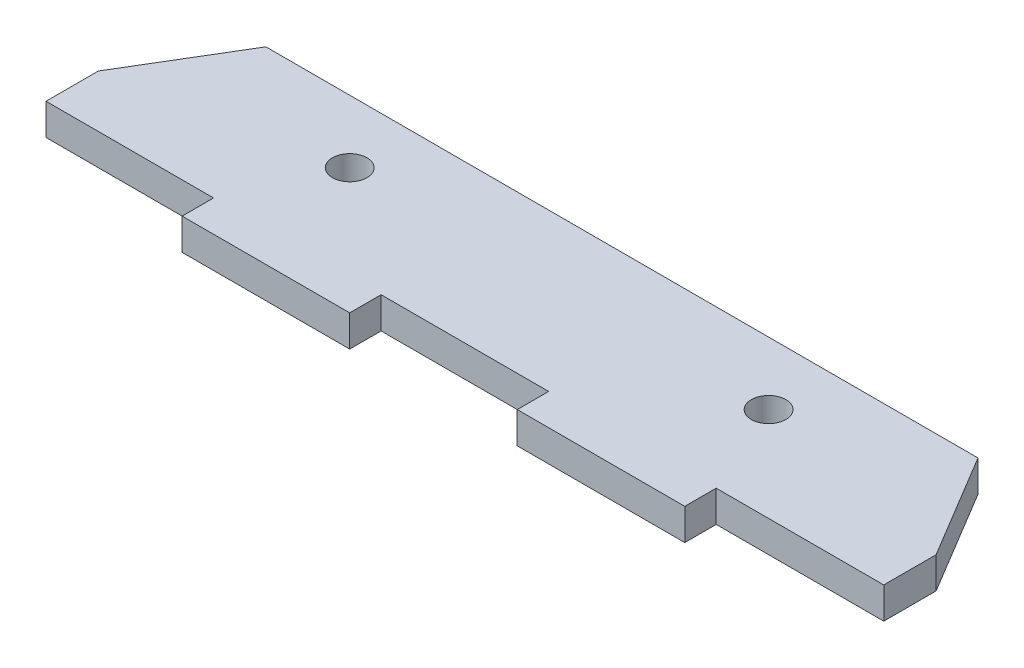
ISO-10303-21;
HEADER;
FILE_DESCRIPTION(('STEP AP214'),'2;1');
FILE_NAME('part.step','',(''),(''),'','','');
FILE_SCHEMA(('AUTOMOTIVE_DESIGN { 1 0 10303 214 1 1 1 1 }'));
ENDSEC;
DATA;
#1=APPLICATION_CONTEXT('core data for automotive mechanical design processes');
#2=APPLICATION_PROTOCOL_DEFINITION('international standard','automotive_design',2000,#1);
#3=PRODUCT_CONTEXT('',#1,'mechanical');
#4=PRODUCT('Part','Part','',(#3));
#5=PRODUCT_RELATED_PRODUCT_CATEGORY('part','',(#4));
#6=PRODUCT_DEFINITION_FORMATION('','',#4);
#7=PRODUCT_DEFINITION_CONTEXT('part definition',#1,'design');
#8=PRODUCT_DEFINITION('design','',#6,#7);
#9=PRODUCT_DEFINITION_SHAPE('','',#8);
#10=(LENGTH_UNIT() NAMED_UNIT(*) SI_UNIT(.MILLI.,.METRE.));
#11=(NAMED_UNIT(*) PLANE_ANGLE_UNIT() SI_UNIT($,.RADIAN.));
#12=(NAMED_UNIT(*) SI_UNIT($,.STERADIAN.) SOLID_ANGLE_UNIT());
#13=UNCERTAINTY_MEASURE_WITH_UNIT(LENGTH_MEASURE(1.E-05),#10,'distance_accuracy_value','');
#14=(GEOMETRIC_REPRESENTATION_CONTEXT(3) GLOBAL_UNCERTAINTY_ASSIGNED_CONTEXT((#13)) GLOBAL_UNIT_ASSIGNED_CONTEXT((#10,
#11,#12)) REPRESENTATION_CONTEXT('',''));
#15=CARTESIAN_POINT('',(0.,0.,0.));
#16=DIRECTION('',(0.,0.,1.));
#17=DIRECTION('',(1.,0.,0.));
#18=AXIS2_PLACEMENT_3D('',#15,#16,#17);
#19=CARTESIAN_POINT('',(0.,3.,0.));
#20=DIRECTION('',(0.,-1.,0.));
#21=DIRECTION('',(0.,0.,-1.));
#22=AXIS2_PLACEMENT_3D('',#19,#20,#21);
#23=PLANE('',#22);
#24=DIRECTION('',(-1.,0.,0.));
#25=VECTOR('',#24,1.);
#26=CARTESIAN_POINT('',(-34.,3.,-9.));
#27=LINE('',#26,#25);
#28=CARTESIAN_POINT('',(34.,3.,-9.));
#29=VERTEX_POINT('',#28);
#30=CARTESIAN_POINT('',(-34.,3.,-9.));
#31=VERTEX_POINT('',#30);
#32=EDGE_CURVE('E193',#29,#31,#27,.T.);
#33=ORIENTED_EDGE('',*,*,#32,.T.);
#34=DIRECTION('',(-0.514495755427526,0.,0.857492925712545));
#35=VECTOR('',#34,1.);
#36=CARTESIAN_POINT('',(-40.,3.,0.999999999999999));
#37=LINE('',#36,#35);
#38=CARTESIAN_POINT('',(-40.,3.,0.999999999999999));
#39=VERTEX_POINT('',#38);
#40=EDGE_CURVE('E111',#31,#39,#37,.T.);
#41=ORIENTED_EDGE('',*,*,#40,.T.);
#42=DIRECTION('',(0.,0.,1.));
#43=VECTOR('',#42,1.);
#44=CARTESIAN_POINT('',(-40.,3.,0.999999999999999));
#45=LINE('',#44,#43);
#46=CARTESIAN_POINT('',(-40.,3.,6.));
#47=VERTEX_POINT('',#46);
#48=EDGE_CURVE('E226',#39,#47,#45,.T.);
#49=ORIENTED_EDGE('',*,*,#48,.T.);
#50=DIRECTION('',(1.,0.,0.));
#51=VECTOR('',#50,1.);
#52=CARTESIAN_POINT('',(-40.,3.,6.));
#53=LINE('',#52,#51);
#54=CARTESIAN_POINT('',(-24.,3.,6.));
#55=VERTEX_POINT('',#54);
#56=EDGE_CURVE('E245',#47,#55,#53,.T.);
#57=ORIENTED_EDGE('',*,*,#56,.T.);
#58=DIRECTION('',(0.,0.,1.));
#59=VECTOR('',#58,1.);
#60=CARTESIAN_POINT('',(-24.,3.,6.));
#61=LINE('',#60,#59);
#62=CARTESIAN_POINT('',(-24.,3.,9.));
#63=VERTEX_POINT('',#62);
#64=EDGE_CURVE('E242',#55,#63,#61,.T.);
#65=ORIENTED_EDGE('',*,*,#64,.T.);
#66=DIRECTION('',(1.,0.,0.));
#67=VECTOR('',#66,1.);
#68=CARTESIAN_POINT('',(-24.,3.,9.));
#69=LINE('',#68,#67);
#70=CARTESIAN_POINT('',(-8.,3.,8.99999999999999));
#71=VERTEX_POINT('',#70);
#72=EDGE_CURVE('E244',#63,#71,#69,.T.);
#73=ORIENTED_EDGE('',*,*,#72,.T.);
#74=DIRECTION('',(0.,0.,-1.));
#75=VECTOR('',#74,1.);
#76=CARTESIAN_POINT('',(-8.,3.,8.99999999999999));
#77=LINE('',#76,#75);
#78=CARTESIAN_POINT('',(-8.,3.,6.));
#79=VERTEX_POINT('',#78);
#80=EDGE_CURVE('E247',#71,#79,#77,.T.);
#81=ORIENTED_EDGE('',*,*,#80,.T.);
#82=DIRECTION('',(1.,0.,0.));
#83=VECTOR('',#82,1.);
#84=CARTESIAN_POINT('',(-8.,3.,6.));
#85=LINE('',#84,#83);
#86=CARTESIAN_POINT('',(8.,3.,6.));
#87=VERTEX_POINT('',#86);
#88=EDGE_CURVE('E253',#79,#87,#85,.T.);
#89=ORIENTED_EDGE('',*,*,#88,.T.);
#90=DIRECTION('',(0.,0.,1.));
#91=VECTOR('',#90,1.);
#92=CARTESIAN_POINT('',(8.,3.,6.));
#93=LINE('',#92,#91);
#94=CARTESIAN_POINT('',(8.,3.,9.));
#95=VERTEX_POINT('',#94);
#96=EDGE_CURVE('E255',#87,#95,#93,.T.);
#97=ORIENTED_EDGE('',*,*,#96,.T.);
#98=DIRECTION('',(1.,0.,0.));
#99=VECTOR('',#98,1.);
#100=CARTESIAN_POINT('',(8.,3.,9.));
#101=LINE('',#100,#99);
#102=CARTESIAN_POINT('',(24.,3.,8.99999999999999));
#103=VERTEX_POINT('',#102);
#104=EDGE_CURVE('E257',#95,#103,#101,.T.);
#105=ORIENTED_EDGE('',*,*,#104,.T.);
#106=DIRECTION('',(0.,0.,-1.));
#107=VECTOR('',#106,1.);
#108=CARTESIAN_POINT('',(24.,3.,8.99999999999999));
#109=LINE('',#108,#107);
#110=CARTESIAN_POINT('',(24.,3.,6.));
#111=VERTEX_POINT('',#110);
#112=EDGE_CURVE('E148',#103,#111,#109,.T.);
#113=ORIENTED_EDGE('',*,*,#112,.T.);
#114=DIRECTION('',(1.,0.,0.));
#115=VECTOR('',#114,1.);
#116=CARTESIAN_POINT('',(24.,3.,6.));
#117=LINE('',#116,#115);
#118=CARTESIAN_POINT('',(40.,3.,6.));
#119=VERTEX_POINT('',#118);
#120=EDGE_CURVE('E142',#111,#119,#117,.T.);
#121=ORIENTED_EDGE('',*,*,#120,.T.);
#122=DIRECTION('',(0.,0.,-1.));
#123=VECTOR('',#122,1.);
#124=CARTESIAN_POINT('',(40.,3.,0.999999999999999));
#125=LINE('',#124,#123);
#126=CARTESIAN_POINT('',(40.,3.,0.999999999999999));
#127=VERTEX_POINT('',#126);
#128=EDGE_CURVE('E146',#119,#127,#125,.T.);
#129=ORIENTED_EDGE('',*,*,#128,.T.);
#130=DIRECTION('',(-0.514495755427526,0.,-0.857492925712545));
#131=VECTOR('',#130,1.);
#132=CARTESIAN_POINT('',(34.,3.,-9.));
#133=LINE('',#132,#131);
#134=EDGE_CURVE('E50',#127,#29,#133,.T.);
#135=ORIENTED_EDGE('',*,*,#134,.T.);
#136=EDGE_LOOP('',(#33,#41,#49,#57,#65,#73,#81,#89,#97,#105,#113,#121,#129,#135));
#137=FACE_BOUND('',#136,.T.);
#138=CARTESIAN_POINT('',(-20.,3.,-3.00310366211029));
#139=DIRECTION('',(0.,1.,0.));
#140=DIRECTION('',(0.,0.,1.));
#141=AXIS2_PLACEMENT_3D('',#138,#139,#140);
#142=CIRCLE('',#141,1.65);
#143=CARTESIAN_POINT('',(-20.,3.,-1.35310366211029));
#144=VERTEX_POINT('',#143);
#145=EDGE_CURVE('E170',#144,#144,#142,.T.);
#146=ORIENTED_EDGE('',*,*,#145,.F.);
#147=EDGE_LOOP('',(#146));
#148=FACE_BOUND('',#147,.T.);
#149=CARTESIAN_POINT('',(20.,3.,-3.00310366211029));
#150=DIRECTION('',(0.,1.,0.));
#151=DIRECTION('',(0.,0.,1.));
#152=AXIS2_PLACEMENT_3D('',#149,#150,#151);
#153=CIRCLE('',#152,1.65);
#154=CARTESIAN_POINT('',(20.,3.,-1.35310366211029));
#155=VERTEX_POINT('',#154);
#156=EDGE_CURVE('E298',#155,#155,#153,.T.);
#157=ORIENTED_EDGE('',*,*,#156,.F.);
#158=EDGE_LOOP('',(#157));
#159=FACE_BOUND('',#158,.T.);
#160=ADVANCED_FACE('F33',(#137,#148,#159),#23,.F.);
#161=CARTESIAN_POINT('',(0.,0.,0.));
#162=DIRECTION('',(0.,-1.,0.));
#163=DIRECTION('',(0.,0.,-1.));
#164=AXIS2_PLACEMENT_3D('',#161,#162,#163);
#165=PLANE('',#164);
#166=CARTESIAN_POINT('',(-20.,0.,-3.00310366211029));
#167=DIRECTION('',(0.,1.,0.));
#168=DIRECTION('',(0.,0.,1.));
#169=AXIS2_PLACEMENT_3D('',#166,#167,#168);
#170=CIRCLE('',#169,1.65);
#171=CARTESIAN_POINT('',(-20.,0.,-1.35310366211029));
#172=VERTEX_POINT('',#171);
#173=EDGE_CURVE('E303',#172,#172,#170,.T.);
#174=ORIENTED_EDGE('',*,*,#173,.T.);
#175=EDGE_LOOP('',(#174));
#176=FACE_BOUND('',#175,.T.);
#177=DIRECTION('',(-1.,0.,0.));
#178=VECTOR('',#177,1.);
#179=CARTESIAN_POINT('',(-34.,0.,-9.));
#180=LINE('',#179,#178);
#181=CARTESIAN_POINT('',(34.,0.,-9.));
#182=VERTEX_POINT('',#181);
#183=CARTESIAN_POINT('',(-34.,0.,-9.));
#184=VERTEX_POINT('',#183);
#185=EDGE_CURVE('E166',#182,#184,#180,.T.);
#186=ORIENTED_EDGE('',*,*,#185,.F.);
#187=DIRECTION('',(-0.514495755427526,0.,-0.857492925712545));
#188=VECTOR('',#187,1.);
#189=CARTESIAN_POINT('',(34.,0.,-9.));
#190=LINE('',#189,#188);
#191=CARTESIAN_POINT('',(40.,0.,0.999999999999999));
#192=VERTEX_POINT('',#191);
#193=EDGE_CURVE('E103',#192,#182,#190,.T.);
#194=ORIENTED_EDGE('',*,*,#193,.F.);
#195=DIRECTION('',(0.,0.,-1.));
#196=VECTOR('',#195,1.);
#197=CARTESIAN_POINT('',(40.,0.,0.999999999999999));
#198=LINE('',#197,#196);
#199=CARTESIAN_POINT('',(40.,0.,6.));
#200=VERTEX_POINT('',#199);
#201=EDGE_CURVE('E97',#200,#192,#198,.T.);
#202=ORIENTED_EDGE('',*,*,#201,.F.);
#203=DIRECTION('',(1.,0.,0.));
#204=VECTOR('',#203,1.);
#205=CARTESIAN_POINT('',(24.,0.,6.));
#206=LINE('',#205,#204);
#207=CARTESIAN_POINT('',(24.,0.,6.));
#208=VERTEX_POINT('',#207);
#209=EDGE_CURVE('E156',#208,#200,#206,.T.);
#210=ORIENTED_EDGE('',*,*,#209,.F.);
#211=DIRECTION('',(0.,0.,-1.));
#212=VECTOR('',#211,1.);
#213=CARTESIAN_POINT('',(24.,0.,8.99999999999999));
#214=LINE('',#213,#212);
#215=CARTESIAN_POINT('',(24.,0.,8.99999999999999));
#216=VERTEX_POINT('',#215);
#217=EDGE_CURVE('E188',#216,#208,#214,.T.);
#218=ORIENTED_EDGE('',*,*,#217,.F.);
#219=DIRECTION('',(1.,0.,0.));
#220=VECTOR('',#219,1.);
#221=CARTESIAN_POINT('',(8.,0.,9.));
#222=LINE('',#221,#220);
#223=CARTESIAN_POINT('',(8.,0.,9.));
#224=VERTEX_POINT('',#223);
#225=EDGE_CURVE('E186',#224,#216,#222,.T.);
#226=ORIENTED_EDGE('',*,*,#225,.F.);
#227=DIRECTION('',(0.,0.,1.));
#228=VECTOR('',#227,1.);
#229=CARTESIAN_POINT('',(8.,0.,6.));
#230=LINE('',#229,#228);
#231=CARTESIAN_POINT('',(8.,0.,6.));
#232=VERTEX_POINT('',#231);
#233=EDGE_CURVE('E184',#232,#224,#230,.T.);
#234=ORIENTED_EDGE('',*,*,#233,.F.);
#235=DIRECTION('',(1.,0.,0.));
#236=VECTOR('',#235,1.);
#237=CARTESIAN_POINT('',(-8.,0.,6.));
#238=LINE('',#237,#236);
#239=CARTESIAN_POINT('',(-8.,0.,6.));
#240=VERTEX_POINT('',#239);
#241=EDGE_CURVE('E182',#240,#232,#238,.T.);
#242=ORIENTED_EDGE('',*,*,#241,.F.);
#243=DIRECTION('',(0.,0.,-1.));
#244=VECTOR('',#243,1.);
#245=CARTESIAN_POINT('',(-8.,0.,8.99999999999999));
#246=LINE('',#245,#244);
#247=CARTESIAN_POINT('',(-8.,0.,8.99999999999999));
#248=VERTEX_POINT('',#247);
#249=EDGE_CURVE('E180',#248,#240,#246,.T.);
#250=ORIENTED_EDGE('',*,*,#249,.F.);
#251=DIRECTION('',(1.,0.,0.));
#252=VECTOR('',#251,1.);
#253=CARTESIAN_POINT('',(-24.,0.,9.));
#254=LINE('',#253,#252);
#255=CARTESIAN_POINT('',(-24.,0.,9.));
#256=VERTEX_POINT('',#255);
#257=EDGE_CURVE('E178',#256,#248,#254,.T.);
#258=ORIENTED_EDGE('',*,*,#257,.F.);
#259=DIRECTION('',(0.,0.,1.));
#260=VECTOR('',#259,1.);
#261=CARTESIAN_POINT('',(-24.,0.,6.));
#262=LINE('',#261,#260);
#263=CARTESIAN_POINT('',(-24.,0.,6.));
#264=VERTEX_POINT('',#263);
#265=EDGE_CURVE('E176',#264,#256,#262,.T.);
#266=ORIENTED_EDGE('',*,*,#265,.F.);
#267=DIRECTION('',(1.,0.,0.));
#268=VECTOR('',#267,1.);
#269=CARTESIAN_POINT('',(-40.,0.,6.));
#270=LINE('',#269,#268);
#271=CARTESIAN_POINT('',(-40.,0.,6.));
#272=VERTEX_POINT('',#271);
#273=EDGE_CURVE('E174',#272,#264,#270,.T.);
#274=ORIENTED_EDGE('',*,*,#273,.F.);
#275=DIRECTION('',(0.,0.,1.));
#276=VECTOR('',#275,1.);
#277=CARTESIAN_POINT('',(-40.,0.,0.999999999999999));
#278=LINE('',#277,#276);
#279=CARTESIAN_POINT('',(-40.,0.,0.999999999999999));
#280=VERTEX_POINT('',#279);
#281=EDGE_CURVE('E172',#280,#272,#278,.T.);
#282=ORIENTED_EDGE('',*,*,#281,.F.);
#283=DIRECTION('',(-0.514495755427526,0.,0.857492925712545));
#284=VECTOR('',#283,1.);
#285=CARTESIAN_POINT('',(-40.,0.,0.999999999999999));
#286=LINE('',#285,#284);
#287=EDGE_CURVE('E169',#184,#280,#286,.T.);
#288=ORIENTED_EDGE('',*,*,#287,.F.);
#289=EDGE_LOOP('',(#186,#194,#202,#210,#218,#226,#234,#242,#250,#258,#266,#274,#282,#288));
#290=FACE_BOUND('',#289,.T.);
#291=CARTESIAN_POINT('',(20.,0.,-3.00310366211029));
#292=DIRECTION('',(0.,1.,0.));
#293=DIRECTION('',(0.,0.,1.));
#294=AXIS2_PLACEMENT_3D('',#291,#292,#293);
#295=CIRCLE('',#294,1.65);
#296=CARTESIAN_POINT('',(20.,0.,-1.35310366211029));
#297=VERTEX_POINT('',#296);
#298=EDGE_CURVE('E301',#297,#297,#295,.T.);
#299=ORIENTED_EDGE('',*,*,#298,.T.);
#300=EDGE_LOOP('',(#299));
#301=FACE_BOUND('',#300,.T.);
#302=ADVANCED_FACE('F230',(#176,#290,#301),#165,.T.);
#303=CARTESIAN_POINT('',(-34.,3.,-9.));
#304=DIRECTION('',(0.,0.,1.));
#305=DIRECTION('',(1.,0.,0.));
#306=AXIS2_PLACEMENT_3D('',#303,#304,#305);
#307=PLANE('',#306);
#308=ORIENTED_EDGE('',*,*,#185,.T.);
#309=DIRECTION('',(0.,-1.,0.));
#310=VECTOR('',#309,1.);
#311=CARTESIAN_POINT('',(-34.,3.,-9.));
#312=LINE('',#311,#310);
#313=EDGE_CURVE('E11',#31,#184,#312,.T.);
#314=ORIENTED_EDGE('',*,*,#313,.F.);
#315=ORIENTED_EDGE('',*,*,#32,.F.);
#316=DIRECTION('',(0.,-1.,0.));
#317=VECTOR('',#316,1.);
#318=CARTESIAN_POINT('',(34.,3.,-9.));
#319=LINE('',#318,#317);
#320=EDGE_CURVE('E162',#29,#182,#319,.T.);
#321=ORIENTED_EDGE('',*,*,#320,.T.);
#322=EDGE_LOOP('',(#308,#314,#315,#321));
#323=FACE_BOUND('',#322,.T.);
#324=ADVANCED_FACE('F35',(#323),#307,.F.);
#325=CARTESIAN_POINT('',(-40.,3.,0.999999999999999));
#326=DIRECTION('',(0.857492925712544,0.,0.514495755427526));
#327=DIRECTION('',(0.514495755427526,0.,-0.857492925712545));
#328=AXIS2_PLACEMENT_3D('',#325,#326,#327);
#329=PLANE('',#328);
#330=ORIENTED_EDGE('',*,*,#287,.T.);
#331=DIRECTION('',(0.,-1.,0.));
#332=VECTOR('',#331,1.);
#333=CARTESIAN_POINT('',(-40.,3.,0.999999999999999));
#334=LINE('',#333,#332);
#335=EDGE_CURVE('E42',#39,#280,#334,.T.);
#336=ORIENTED_EDGE('',*,*,#335,.F.);
#337=ORIENTED_EDGE('',*,*,#40,.F.);
#338=ORIENTED_EDGE('',*,*,#313,.T.);
#339=EDGE_LOOP('',(#330,#336,#337,#338));
#340=FACE_BOUND('',#339,.T.);
#341=ADVANCED_FACE('F418',(#340),#329,.F.);
#342=CARTESIAN_POINT('',(-40.,3.,0.999999999999999));
#343=DIRECTION('',(1.,0.,0.));
#344=DIRECTION('',(0.,0.,-1.));
#345=AXIS2_PLACEMENT_3D('',#342,#343,#344);
#346=PLANE('',#345);
#347=ORIENTED_EDGE('',*,*,#281,.T.);
#348=DIRECTION('',(0.,-1.,0.));
#349=VECTOR('',#348,1.);
#350=CARTESIAN_POINT('',(-40.,3.,6.));
#351=LINE('',#350,#349);
#352=EDGE_CURVE('E218',#47,#272,#351,.T.);
#353=ORIENTED_EDGE('',*,*,#352,.F.);
#354=ORIENTED_EDGE('',*,*,#48,.F.);
#355=ORIENTED_EDGE('',*,*,#335,.T.);
#356=EDGE_LOOP('',(#347,#353,#354,#355));
#357=FACE_BOUND('',#356,.T.);
#358=ADVANCED_FACE('F224',(#357),#346,.F.);
#359=CARTESIAN_POINT('',(-40.,3.,6.));
#360=DIRECTION('',(0.,0.,-1.));
#361=DIRECTION('',(-1.,0.,0.));
#362=AXIS2_PLACEMENT_3D('',#359,#360,#361);
#363=PLANE('',#362);
#364=ORIENTED_EDGE('',*,*,#273,.T.);
#365=DIRECTION('',(0.,-1.,0.));
#366=VECTOR('',#365,1.);
#367=CARTESIAN_POINT('',(-24.,3.,6.));
#368=LINE('',#367,#366);
#369=EDGE_CURVE('E215',#55,#264,#368,.T.);
#370=ORIENTED_EDGE('',*,*,#369,.F.);
#371=ORIENTED_EDGE('',*,*,#56,.F.);
#372=ORIENTED_EDGE('',*,*,#352,.T.);
#373=EDGE_LOOP('',(#364,#370,#371,#372));
#374=FACE_BOUND('',#373,.T.);
#375=ADVANCED_FACE('F236',(#374),#363,.F.);
#376=CARTESIAN_POINT('',(-24.,3.,6.));
#377=DIRECTION('',(1.,0.,0.));
#378=DIRECTION('',(0.,0.,-1.));
#379=AXIS2_PLACEMENT_3D('',#376,#377,#378);
#380=PLANE('',#379);
#381=ORIENTED_EDGE('',*,*,#265,.T.);
#382=DIRECTION('',(0.,-1.,0.));
#383=VECTOR('',#382,1.);
#384=CARTESIAN_POINT('',(-24.,3.,9.));
#385=LINE('',#384,#383);
#386=EDGE_CURVE('E212',#63,#256,#385,.T.);
#387=ORIENTED_EDGE('',*,*,#386,.F.);
#388=ORIENTED_EDGE('',*,*,#64,.F.);
#389=ORIENTED_EDGE('',*,*,#369,.T.);
#390=EDGE_LOOP('',(#381,#387,#388,#389));
#391=FACE_BOUND('',#390,.T.);
#392=ADVANCED_FACE('F240',(#391),#380,.F.);
#393=CARTESIAN_POINT('',(-24.,3.,9.));
#394=DIRECTION('',(0.,0.,-1.));
#395=DIRECTION('',(-1.,0.,0.));
#396=AXIS2_PLACEMENT_3D('',#393,#394,#395);
#397=PLANE('',#396);
#398=ORIENTED_EDGE('',*,*,#257,.T.);
#399=DIRECTION('',(0.,-1.,0.));
#400=VECTOR('',#399,1.);
#401=CARTESIAN_POINT('',(-8.,3.,8.99999999999999));
#402=LINE('',#401,#400);
#403=EDGE_CURVE('E209',#71,#248,#402,.T.);
#404=ORIENTED_EDGE('',*,*,#403,.F.);
#405=ORIENTED_EDGE('',*,*,#72,.F.);
#406=ORIENTED_EDGE('',*,*,#386,.T.);
#407=EDGE_LOOP('',(#398,#404,#405,#406));
#408=FACE_BOUND('',#407,.T.);
#409=ADVANCED_FACE('F383',(#408),#397,.F.);
#410=CARTESIAN_POINT('',(-8.,3.,8.99999999999999));
#411=DIRECTION('',(-1.,0.,0.));
#412=DIRECTION('',(0.,0.,1.));
#413=AXIS2_PLACEMENT_3D('',#410,#411,#412);
#414=PLANE('',#413);
#415=ORIENTED_EDGE('',*,*,#249,.T.);
#416=DIRECTION('',(0.,-1.,0.));
#417=VECTOR('',#416,1.);
#418=CARTESIAN_POINT('',(-8.,3.,6.));
#419=LINE('',#418,#417);
#420=EDGE_CURVE('E206',#79,#240,#419,.T.);
#421=ORIENTED_EDGE('',*,*,#420,.F.);
#422=ORIENTED_EDGE('',*,*,#80,.F.);
#423=ORIENTED_EDGE('',*,*,#403,.T.);
#424=EDGE_LOOP('',(#415,#421,#422,#423));
#425=FACE_BOUND('',#424,.T.);
#426=ADVANCED_FACE('F373',(#425),#414,.F.);
#427=CARTESIAN_POINT('',(-8.,3.,6.));
#428=DIRECTION('',(0.,0.,-1.));
#429=DIRECTION('',(-1.,0.,0.));
#430=AXIS2_PLACEMENT_3D('',#427,#428,#429);
#431=PLANE('',#430);
#432=ORIENTED_EDGE('',*,*,#241,.T.);
#433=DIRECTION('',(0.,-1.,0.));
#434=VECTOR('',#433,1.);
#435=CARTESIAN_POINT('',(8.,3.,6.));
#436=LINE('',#435,#434);
#437=EDGE_CURVE('E203',#87,#232,#436,.T.);
#438=ORIENTED_EDGE('',*,*,#437,.F.);
#439=ORIENTED_EDGE('',*,*,#88,.F.);
#440=ORIENTED_EDGE('',*,*,#420,.T.);
#441=EDGE_LOOP('',(#432,#438,#439,#440));
#442=FACE_BOUND('',#441,.T.);
#443=ADVANCED_FACE('F363',(#442),#431,.F.);
#444=CARTESIAN_POINT('',(8.,3.,6.));
#445=DIRECTION('',(1.,0.,0.));
#446=DIRECTION('',(0.,0.,-1.));
#447=AXIS2_PLACEMENT_3D('',#444,#445,#446);
#448=PLANE('',#447);
#449=ORIENTED_EDGE('',*,*,#233,.T.);
#450=DIRECTION('',(0.,-1.,0.));
#451=VECTOR('',#450,1.);
#452=CARTESIAN_POINT('',(8.,3.,9.));
#453=LINE('',#452,#451);
#454=EDGE_CURVE('E200',#95,#224,#453,.T.);
#455=ORIENTED_EDGE('',*,*,#454,.F.);
#456=ORIENTED_EDGE('',*,*,#96,.F.);
#457=ORIENTED_EDGE('',*,*,#437,.T.);
#458=EDGE_LOOP('',(#449,#455,#456,#457));
#459=FACE_BOUND('',#458,.T.);
#460=ADVANCED_FACE('F354',(#459),#448,.F.);
#461=CARTESIAN_POINT('',(8.,3.,9.));
#462=DIRECTION('',(0.,0.,-1.));
#463=DIRECTION('',(-1.,0.,0.));
#464=AXIS2_PLACEMENT_3D('',#461,#462,#463);
#465=PLANE('',#464);
#466=ORIENTED_EDGE('',*,*,#225,.T.);
#467=DIRECTION('',(0.,-1.,0.));
#468=VECTOR('',#467,1.);
#469=CARTESIAN_POINT('',(24.,3.,8.99999999999999));
#470=LINE('',#469,#468);
#471=EDGE_CURVE('E197',#103,#216,#470,.T.);
#472=ORIENTED_EDGE('',*,*,#471,.F.);
#473=ORIENTED_EDGE('',*,*,#104,.F.);
#474=ORIENTED_EDGE('',*,*,#454,.T.);
#475=EDGE_LOOP('',(#466,#472,#473,#474));
#476=FACE_BOUND('',#475,.T.);
#477=ADVANCED_FACE('F263',(#476),#465,.F.);
#478=CARTESIAN_POINT('',(24.,3.,8.99999999999999));
#479=DIRECTION('',(-1.,0.,0.));
#480=DIRECTION('',(0.,0.,1.));
#481=AXIS2_PLACEMENT_3D('',#478,#479,#480);
#482=PLANE('',#481);
#483=ORIENTED_EDGE('',*,*,#217,.T.);
#484=DIRECTION('',(0.,-1.,0.));
#485=VECTOR('',#484,1.);
#486=CARTESIAN_POINT('',(24.,3.,6.));
#487=LINE('',#486,#485);
#488=EDGE_CURVE('E157',#111,#208,#487,.T.);
#489=ORIENTED_EDGE('',*,*,#488,.F.);
#490=ORIENTED_EDGE('',*,*,#112,.F.);
#491=ORIENTED_EDGE('',*,*,#471,.T.);
#492=EDGE_LOOP('',(#483,#489,#490,#491));
#493=FACE_BOUND('',#492,.T.);
#494=ADVANCED_FACE('F267',(#493),#482,.F.);
#495=CARTESIAN_POINT('',(24.,3.,6.));
#496=DIRECTION('',(0.,0.,-1.));
#497=DIRECTION('',(-1.,0.,0.));
#498=AXIS2_PLACEMENT_3D('',#495,#496,#497);
#499=PLANE('',#498);
#500=ORIENTED_EDGE('',*,*,#209,.T.);
#501=DIRECTION('',(0.,-1.,0.));
#502=VECTOR('',#501,1.);
#503=CARTESIAN_POINT('',(40.,3.,6.));
#504=LINE('',#503,#502);
#505=EDGE_CURVE('E153',#119,#200,#504,.T.);
#506=ORIENTED_EDGE('',*,*,#505,.F.);
#507=ORIENTED_EDGE('',*,*,#120,.F.);
#508=ORIENTED_EDGE('',*,*,#488,.T.);
#509=EDGE_LOOP('',(#500,#506,#507,#508));
#510=FACE_BOUND('',#509,.T.);
#511=ADVANCED_FACE('F154',(#510),#499,.F.);
#512=CARTESIAN_POINT('',(40.,3.,0.999999999999999));
#513=DIRECTION('',(-1.,0.,0.));
#514=DIRECTION('',(0.,0.,1.));
#515=AXIS2_PLACEMENT_3D('',#512,#513,#514);
#516=PLANE('',#515);
#517=ORIENTED_EDGE('',*,*,#201,.T.);
#518=DIRECTION('',(0.,-1.,0.));
#519=VECTOR('',#518,1.);
#520=CARTESIAN_POINT('',(40.,3.,0.999999999999999));
#521=LINE('',#520,#519);
#522=EDGE_CURVE('E158',#127,#192,#521,.T.);
#523=ORIENTED_EDGE('',*,*,#522,.F.);
#524=ORIENTED_EDGE('',*,*,#128,.F.);
#525=ORIENTED_EDGE('',*,*,#505,.T.);
#526=EDGE_LOOP('',(#517,#523,#524,#525));
#527=FACE_BOUND('',#526,.T.);
#528=ADVANCED_FACE('F160',(#527),#516,.F.);
#529=CARTESIAN_POINT('',(34.,3.,-9.));
#530=DIRECTION('',(-0.857492925712544,0.,0.514495755427526));
#531=DIRECTION('',(0.514495755427526,0.,0.857492925712545));
#532=AXIS2_PLACEMENT_3D('',#529,#530,#531);
#533=PLANE('',#532);
#534=ORIENTED_EDGE('',*,*,#193,.T.);
#535=ORIENTED_EDGE('',*,*,#320,.F.);
#536=ORIENTED_EDGE('',*,*,#134,.F.);
#537=ORIENTED_EDGE('',*,*,#522,.T.);
#538=EDGE_LOOP('',(#534,#535,#536,#537));
#539=FACE_BOUND('',#538,.T.);
#540=ADVANCED_FACE('F271',(#539),#533,.F.);
#541=CARTESIAN_POINT('',(-20.,3.,-3.00310366211029));
#542=DIRECTION('',(0.,-1.,0.));
#543=DIRECTION('',(0.,0.,-1.));
#544=AXIS2_PLACEMENT_3D('',#541,#542,#543);
#545=CYLINDRICAL_SURFACE('',#544,1.65);
#546=ORIENTED_EDGE('',*,*,#145,.T.);
#547=EDGE_LOOP('',(#546));
#548=FACE_BOUND('',#547,.T.);
#549=ORIENTED_EDGE('',*,*,#173,.F.);
#550=EDGE_LOOP('',(#549));
#551=FACE_BOUND('',#550,.T.);
#552=ADVANCED_FACE('F273',(#548,#551),#545,.F.);
#553=CARTESIAN_POINT('',(20.,3.,-3.00310366211029));
#554=DIRECTION('',(0.,-1.,0.));
#555=DIRECTION('',(0.,0.,-1.));
#556=AXIS2_PLACEMENT_3D('',#553,#554,#555);
#557=CYLINDRICAL_SURFACE('',#556,1.65);
#558=ORIENTED_EDGE('',*,*,#156,.T.);
#559=EDGE_LOOP('',(#558));
#560=FACE_BOUND('',#559,.T.);
#561=ORIENTED_EDGE('',*,*,#298,.F.);
#562=EDGE_LOOP('',(#561));
#563=FACE_BOUND('',#562,.T.);
#564=ADVANCED_FACE('F279',(#560,#563),#557,.F.);
#565=CLOSED_SHELL('',(#160,#302,#324,#341,#358,#375,#392,#409,#426,#443,#460,#477,#494,#511,
#528,#540,#552,#564));
#566=MANIFOLD_SOLID_BREP('B2',#565);
#567=ADVANCED_BREP_SHAPE_REPRESENTATION('',(#18,#566),#14);
#568=SHAPE_DEFINITION_REPRESENTATION(#9,#567);
ENDSEC;
END-ISO-10303-21;
